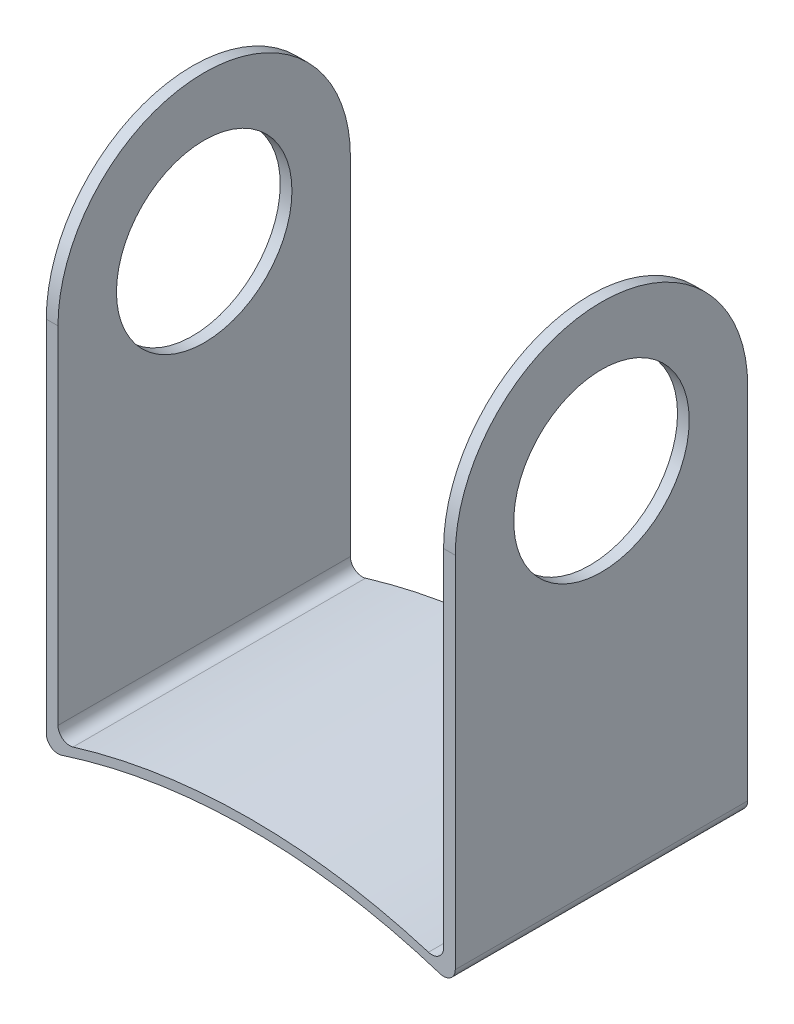
ISO-10303-21;
HEADER;
FILE_DESCRIPTION(('STEP AP214'),'2;1');
FILE_NAME('part.step','',(''),(''),'','','');
FILE_SCHEMA(('AUTOMOTIVE_DESIGN { 1 0 10303 214 1 1 1 1 }'));
ENDSEC;
DATA;
#1=APPLICATION_CONTEXT('core data for automotive mechanical design processes');
#2=APPLICATION_PROTOCOL_DEFINITION('international standard','automotive_design',2000,#1);
#3=PRODUCT_CONTEXT('',#1,'mechanical');
#4=PRODUCT('Part','Part','',(#3));
#5=PRODUCT_RELATED_PRODUCT_CATEGORY('part','',(#4));
#6=PRODUCT_DEFINITION_FORMATION('','',#4);
#7=PRODUCT_DEFINITION_CONTEXT('part definition',#1,'design');
#8=PRODUCT_DEFINITION('design','',#6,#7);
#9=PRODUCT_DEFINITION_SHAPE('','',#8);
#10=(LENGTH_UNIT() NAMED_UNIT(*) SI_UNIT(.MILLI.,.METRE.));
#11=(NAMED_UNIT(*) PLANE_ANGLE_UNIT() SI_UNIT($,.RADIAN.));
#12=(NAMED_UNIT(*) SI_UNIT($,.STERADIAN.) SOLID_ANGLE_UNIT());
#13=UNCERTAINTY_MEASURE_WITH_UNIT(LENGTH_MEASURE(1.E-05),#10,'distance_accuracy_value','');
#14=(GEOMETRIC_REPRESENTATION_CONTEXT(3) GLOBAL_UNCERTAINTY_ASSIGNED_CONTEXT((#13)) GLOBAL_UNIT_ASSIGNED_CONTEXT((#10,
#11,#12)) REPRESENTATION_CONTEXT('',''));
#15=CARTESIAN_POINT('',(0.,0.,0.));
#16=DIRECTION('',(0.,0.,1.));
#17=DIRECTION('',(1.,0.,0.));
#18=AXIS2_PLACEMENT_3D('',#15,#16,#17);
#19=CARTESIAN_POINT('',(-5.69097850008883,5.57643641199945,25.));
#20=DIRECTION('',(-1.,0.,0.));
#21=DIRECTION('',(0.,0.,1.));
#22=AXIS2_PLACEMENT_3D('',#19,#20,#21);
#23=PLANE('',#22);
#24=CARTESIAN_POINT('',(-5.69097850008883,36.5190090835511,12.5));
#25=DIRECTION('',(-1.,0.,0.));
#26=DIRECTION('',(0.,0.,1.));
#27=AXIS2_PLACEMENT_3D('',#24,#25,#26);
#28=CIRCLE('',#27,7.5);
#29=CARTESIAN_POINT('',(-5.69097850008883,36.5190090835511,20.));
#30=VERTEX_POINT('',#29);
#31=EDGE_CURVE('E148',#30,#30,#28,.T.);
#32=ORIENTED_EDGE('',*,*,#31,.T.);
#33=EDGE_LOOP('',(#32));
#34=FACE_BOUND('',#33,.T.);
#35=DIRECTION('',(0.,1.,0.));
#36=VECTOR('',#35,1.);
#37=CARTESIAN_POINT('',(-5.69097850008883,5.57643641199945,0.));
#38=LINE('',#37,#36);
#39=CARTESIAN_POINT('',(-5.69097850008883,6.9446235449061,0.));
#40=VERTEX_POINT('',#39);
#41=CARTESIAN_POINT('',(-5.69097850008883,36.5190090835511,0.));
#42=VERTEX_POINT('',#41);
#43=EDGE_CURVE('E138',#40,#42,#38,.T.);
#44=ORIENTED_EDGE('',*,*,#43,.T.);
#45=CARTESIAN_POINT('',(-5.69097850008883,36.5190090835511,12.5));
#46=DIRECTION('',(-1.,0.,0.));
#47=DIRECTION('',(0.,0.,1.));
#48=AXIS2_PLACEMENT_3D('',#45,#46,#47);
#49=CIRCLE('',#48,12.5);
#50=CARTESIAN_POINT('',(-5.69097850008883,36.5190090835511,25.));
#51=VERTEX_POINT('',#50);
#52=EDGE_CURVE('E130',#42,#51,#49,.F.);
#53=ORIENTED_EDGE('',*,*,#52,.T.);
#54=DIRECTION('',(0.,1.,0.));
#55=VECTOR('',#54,1.);
#56=CARTESIAN_POINT('',(-5.69097850008883,5.57643641199945,25.));
#57=LINE('',#56,#55);
#58=CARTESIAN_POINT('',(-5.69097850008883,6.9446235449061,25.));
#59=VERTEX_POINT('',#58);
#60=EDGE_CURVE('E164',#59,#51,#57,.T.);
#61=ORIENTED_EDGE('',*,*,#60,.F.);
#62=DIRECTION('',(0.,0.,-1.));
#63=VECTOR('',#62,1.);
#64=CARTESIAN_POINT('',(-5.69097850008883,6.9446235449061,25.));
#65=LINE('',#64,#63);
#66=EDGE_CURVE('E137',#59,#40,#65,.T.);
#67=ORIENTED_EDGE('',*,*,#66,.T.);
#68=EDGE_LOOP('',(#44,#53,#61,#67));
#69=FACE_BOUND('',#68,.T.);
#70=ADVANCED_FACE('F34',(#34,#69),#23,.F.);
#71=CARTESIAN_POINT('',(-6.69097850008883,50.,25.));
#72=DIRECTION('',(1.,0.,0.));
#73=DIRECTION('',(0.,1.,0.));
#74=AXIS2_PLACEMENT_3D('',#71,#72,#73);
#75=PLANE('',#74);
#76=CARTESIAN_POINT('',(-6.69097850008883,36.5190090835511,12.5));
#77=DIRECTION('',(1.,0.,0.));
#78=DIRECTION('',(0.,0.,-1.));
#79=AXIS2_PLACEMENT_3D('',#76,#77,#78);
#80=CIRCLE('',#79,7.5);
#81=CARTESIAN_POINT('',(-6.69097850008883,36.5190090835511,5.));
#82=VERTEX_POINT('',#81);
#83=EDGE_CURVE('E333',#82,#82,#80,.T.);
#84=ORIENTED_EDGE('',*,*,#83,.T.);
#85=EDGE_LOOP('',(#84));
#86=FACE_BOUND('',#85,.T.);
#87=DIRECTION('',(0.,-1.,0.));
#88=VECTOR('',#87,1.);
#89=CARTESIAN_POINT('',(-6.69097850008883,50.,25.));
#90=LINE('',#89,#88);
#91=CARTESIAN_POINT('',(-6.69097850008883,36.5190090835511,25.));
#92=VERTEX_POINT('',#91);
#93=CARTESIAN_POINT('',(-6.69097850008882,5.83988384729005,25.));
#94=VERTEX_POINT('',#93);
#95=EDGE_CURVE('E153',#92,#94,#90,.T.);
#96=ORIENTED_EDGE('',*,*,#95,.F.);
#97=CARTESIAN_POINT('',(-6.69097850008883,36.5190090835511,12.5));
#98=DIRECTION('',(-1.,0.,0.));
#99=DIRECTION('',(0.,0.,1.));
#100=AXIS2_PLACEMENT_3D('',#97,#98,#99);
#101=CIRCLE('',#100,12.5);
#102=CARTESIAN_POINT('',(-6.69097850008883,36.5190090835511,0.));
#103=VERTEX_POINT('',#102);
#104=EDGE_CURVE('E68',#92,#103,#101,.T.);
#105=ORIENTED_EDGE('',*,*,#104,.T.);
#106=DIRECTION('',(0.,-1.,0.));
#107=VECTOR('',#106,1.);
#108=CARTESIAN_POINT('',(-6.69097850008883,50.,0.));
#109=LINE('',#108,#107);
#110=CARTESIAN_POINT('',(-6.69097850008882,5.83988384729005,0.));
#111=VERTEX_POINT('',#110);
#112=EDGE_CURVE('E145',#103,#111,#109,.T.);
#113=ORIENTED_EDGE('',*,*,#112,.T.);
#114=DIRECTION('',(0.,0.,-1.));
#115=VECTOR('',#114,1.);
#116=CARTESIAN_POINT('',(-6.69097850008882,5.83988384729005,25.));
#117=LINE('',#116,#115);
#118=EDGE_CURVE('E155',#111,#94,#117,.F.);
#119=ORIENTED_EDGE('',*,*,#118,.T.);
#120=EDGE_LOOP('',(#96,#105,#113,#119));
#121=FACE_BOUND('',#120,.T.);
#122=ADVANCED_FACE('F259',(#86,#121),#75,.F.);
#123=CARTESIAN_POINT('',(10.7900631667596,-43.9030586080439,25.));
#124=DIRECTION('',(0.,0.,-1.));
#125=DIRECTION('',(-1.,0.,0.));
#126=AXIS2_PLACEMENT_3D('',#123,#124,#125);
#127=PLANE('',#126);
#128=DIRECTION('',(0.,1.,0.));
#129=VECTOR('',#128,1.);
#130=CARTESIAN_POINT('',(28.2711048336079,4.4444790096918,25.));
#131=LINE('',#130,#129);
#132=CARTESIAN_POINT('',(28.2711048336079,5.83988384729005,25.));
#133=VERTEX_POINT('',#132);
#134=CARTESIAN_POINT('',(28.2711048336079,36.5190090835511,25.));
#135=VERTEX_POINT('',#134);
#136=EDGE_CURVE('E158',#133,#135,#131,.T.);
#137=ORIENTED_EDGE('',*,*,#136,.T.);
#138=DIRECTION('',(1.,0.,0.));
#139=VECTOR('',#138,1.);
#140=CARTESIAN_POINT('',(-6.69097850008883,36.5190090835511,25.));
#141=LINE('',#140,#139);
#142=CARTESIAN_POINT('',(27.2711048336079,36.5190090835511,25.));
#143=VERTEX_POINT('',#142);
#144=EDGE_CURVE('E44',#143,#135,#141,.T.);
#145=ORIENTED_EDGE('',*,*,#144,.F.);
#146=DIRECTION('',(0.,1.,0.));
#147=VECTOR('',#146,1.);
#148=CARTESIAN_POINT('',(27.2711048336079,5.57643641199945,25.));
#149=LINE('',#148,#147);
#150=CARTESIAN_POINT('',(27.2711048336079,6.94462354490609,25.));
#151=VERTEX_POINT('',#150);
#152=EDGE_CURVE('E183',#151,#143,#149,.T.);
#153=ORIENTED_EDGE('',*,*,#152,.F.);
#154=CARTESIAN_POINT('',(26.2711048336079,6.94462354490609,25.));
#155=DIRECTION('',(0.,0.,-1.));
#156=DIRECTION('',(-1.,0.,0.));
#157=AXIS2_PLACEMENT_3D('',#154,#155,#156);
#158=CIRCLE('',#157,1.);
#159=CARTESIAN_POINT('',(25.979845757531,5.98797933173027,25.));
#160=VERTEX_POINT('',#159);
#161=EDGE_CURVE('E169',#151,#160,#158,.T.);
#162=ORIENTED_EDGE('',*,*,#161,.T.);
#163=CARTESIAN_POINT('',(10.7900631667596,-43.9030586080439,25.));
#164=DIRECTION('',(0.,0.,-1.));
#165=DIRECTION('',(-1.,0.,0.));
#166=AXIS2_PLACEMENT_3D('',#163,#164,#165);
#167=CIRCLE('',#166,52.1521347776185);
#168=CARTESIAN_POINT('',(-4.39971942401185,5.98797933173028,25.));
#169=VERTEX_POINT('',#168);
#170=EDGE_CURVE('E189',#169,#160,#167,.T.);
#171=ORIENTED_EDGE('',*,*,#170,.F.);
#172=CARTESIAN_POINT('',(-4.69097850008883,6.9446235449061,25.));
#173=DIRECTION('',(0.,0.,-1.));
#174=DIRECTION('',(-1.,0.,0.));
#175=AXIS2_PLACEMENT_3D('',#172,#173,#174);
#176=CIRCLE('',#175,1.);
#177=EDGE_CURVE('E165',#169,#59,#176,.T.);
#178=ORIENTED_EDGE('',*,*,#177,.T.);
#179=ORIENTED_EDGE('',*,*,#60,.T.);
#180=EDGE_CURVE('E132',#92,#51,#141,.T.);
#181=ORIENTED_EDGE('',*,*,#180,.F.);
#182=ORIENTED_EDGE('',*,*,#95,.T.);
#183=CARTESIAN_POINT('',(-5.69097850008883,5.83988384729005,25.));
#184=DIRECTION('',(0.,0.,-1.));
#185=DIRECTION('',(-1.,0.,0.));
#186=AXIS2_PLACEMENT_3D('',#183,#184,#185);
#187=CIRCLE('',#186,1.);
#188=CARTESIAN_POINT('',(-5.38206898915233,4.88879241422329,25.));
#189=VERTEX_POINT('',#188);
#190=EDGE_CURVE('E168',#94,#189,#187,.F.);
#191=ORIENTED_EDGE('',*,*,#190,.T.);
#192=CARTESIAN_POINT('',(10.7900631667596,-44.9030586080439,25.));
#193=DIRECTION('',(0.,0.,-1.));
#194=DIRECTION('',(-1.,0.,0.));
#195=AXIS2_PLACEMENT_3D('',#192,#193,#194);
#196=CIRCLE('',#195,52.3523283788977);
#197=CARTESIAN_POINT('',(26.9621953226714,4.88879241422329,25.));
#198=VERTEX_POINT('',#197);
#199=EDGE_CURVE('E196',#189,#198,#196,.T.);
#200=ORIENTED_EDGE('',*,*,#199,.T.);
#201=CARTESIAN_POINT('',(27.2711048336079,5.83988384729005,25.));
#202=DIRECTION('',(0.,0.,-1.));
#203=DIRECTION('',(-1.,0.,0.));
#204=AXIS2_PLACEMENT_3D('',#201,#202,#203);
#205=CIRCLE('',#204,1.);
#206=EDGE_CURVE('E197',#198,#133,#205,.F.);
#207=ORIENTED_EDGE('',*,*,#206,.T.);
#208=EDGE_LOOP('',(#137,#145,#153,#162,#171,#178,#179,#181,#182,#191,#200,#207));
#209=FACE_BOUND('',#208,.T.);
#210=ADVANCED_FACE('F36',(#209),#127,.F.);
#211=CARTESIAN_POINT('',(10.7900631667596,-43.9030586080439,0.));
#212=DIRECTION('',(0.,0.,-1.));
#213=DIRECTION('',(-1.,0.,0.));
#214=AXIS2_PLACEMENT_3D('',#211,#212,#213);
#215=PLANE('',#214);
#216=DIRECTION('',(1.,0.,0.));
#217=VECTOR('',#216,1.);
#218=CARTESIAN_POINT('',(-6.69097850008883,36.5190090835511,0.));
#219=LINE('',#218,#217);
#220=CARTESIAN_POINT('',(27.2711048336079,36.5190090835511,0.));
#221=VERTEX_POINT('',#220);
#222=CARTESIAN_POINT('',(28.2711048336079,36.5190090835512,0.));
#223=VERTEX_POINT('',#222);
#224=EDGE_CURVE('E52',#221,#223,#219,.T.);
#225=ORIENTED_EDGE('',*,*,#224,.T.);
#226=DIRECTION('',(0.,1.,0.));
#227=VECTOR('',#226,1.);
#228=CARTESIAN_POINT('',(28.2711048336079,4.4444790096918,0.));
#229=LINE('',#228,#227);
#230=CARTESIAN_POINT('',(28.2711048336079,5.83988384729005,0.));
#231=VERTEX_POINT('',#230);
#232=EDGE_CURVE('E194',#231,#223,#229,.T.);
#233=ORIENTED_EDGE('',*,*,#232,.F.);
#234=CARTESIAN_POINT('',(27.2711048336079,5.83988384729005,0.));
#235=DIRECTION('',(0.,0.,-1.));
#236=DIRECTION('',(-1.,0.,0.));
#237=AXIS2_PLACEMENT_3D('',#234,#235,#236);
#238=CIRCLE('',#237,1.);
#239=CARTESIAN_POINT('',(26.9621953226714,4.88879241422329,0.));
#240=VERTEX_POINT('',#239);
#241=EDGE_CURVE('E200',#231,#240,#238,.T.);
#242=ORIENTED_EDGE('',*,*,#241,.T.);
#243=CARTESIAN_POINT('',(10.7900631667596,-44.9030586080439,0.));
#244=DIRECTION('',(0.,0.,-1.));
#245=DIRECTION('',(-1.,0.,0.));
#246=AXIS2_PLACEMENT_3D('',#243,#244,#245);
#247=CIRCLE('',#246,52.3523283788977);
#248=CARTESIAN_POINT('',(-5.38206898915233,4.88879241422329,0.));
#249=VERTEX_POINT('',#248);
#250=EDGE_CURVE('E204',#249,#240,#247,.T.);
#251=ORIENTED_EDGE('',*,*,#250,.F.);
#252=CARTESIAN_POINT('',(-5.69097850008883,5.83988384729005,0.));
#253=DIRECTION('',(0.,0.,-1.));
#254=DIRECTION('',(-1.,0.,0.));
#255=AXIS2_PLACEMENT_3D('',#252,#253,#254);
#256=CIRCLE('',#255,1.);
#257=EDGE_CURVE('E146',#249,#111,#256,.T.);
#258=ORIENTED_EDGE('',*,*,#257,.T.);
#259=ORIENTED_EDGE('',*,*,#112,.F.);
#260=EDGE_CURVE('E74',#103,#42,#219,.T.);
#261=ORIENTED_EDGE('',*,*,#260,.T.);
#262=ORIENTED_EDGE('',*,*,#43,.F.);
#263=CARTESIAN_POINT('',(-4.69097850008883,6.9446235449061,0.));
#264=DIRECTION('',(0.,0.,-1.));
#265=DIRECTION('',(-1.,0.,0.));
#266=AXIS2_PLACEMENT_3D('',#263,#264,#265);
#267=CIRCLE('',#266,1.);
#268=CARTESIAN_POINT('',(-4.39971942401185,5.98797933173028,0.));
#269=VERTEX_POINT('',#268);
#270=EDGE_CURVE('E82',#40,#269,#267,.F.);
#271=ORIENTED_EDGE('',*,*,#270,.T.);
#272=CARTESIAN_POINT('',(10.7900631667596,-43.9030586080439,0.));
#273=DIRECTION('',(0.,0.,-1.));
#274=DIRECTION('',(-1.,0.,0.));
#275=AXIS2_PLACEMENT_3D('',#272,#273,#274);
#276=CIRCLE('',#275,52.1521347776185);
#277=CARTESIAN_POINT('',(25.979845757531,5.98797933173027,0.));
#278=VERTEX_POINT('',#277);
#279=EDGE_CURVE('E176',#269,#278,#276,.T.);
#280=ORIENTED_EDGE('',*,*,#279,.T.);
#281=CARTESIAN_POINT('',(26.2711048336079,6.94462354490609,0.));
#282=DIRECTION('',(0.,0.,-1.));
#283=DIRECTION('',(-1.,0.,0.));
#284=AXIS2_PLACEMENT_3D('',#281,#282,#283);
#285=CIRCLE('',#284,1.);
#286=CARTESIAN_POINT('',(27.2711048336079,6.94462354490609,0.));
#287=VERTEX_POINT('',#286);
#288=EDGE_CURVE('E178',#278,#287,#285,.F.);
#289=ORIENTED_EDGE('',*,*,#288,.T.);
#290=DIRECTION('',(0.,1.,0.));
#291=VECTOR('',#290,1.);
#292=CARTESIAN_POINT('',(27.2711048336079,5.57643641199945,0.));
#293=LINE('',#292,#291);
#294=EDGE_CURVE('E179',#287,#221,#293,.T.);
#295=ORIENTED_EDGE('',*,*,#294,.T.);
#296=EDGE_LOOP('',(#225,#233,#242,#251,#258,#259,#261,#262,#271,#280,#289,#295));
#297=FACE_BOUND('',#296,.T.);
#298=ADVANCED_FACE('F143',(#297),#215,.T.);
#299=CARTESIAN_POINT('',(10.7900631667596,-43.9030586080439,25.));
#300=DIRECTION('',(0.,0.,-1.));
#301=DIRECTION('',(-1.,0.,0.));
#302=AXIS2_PLACEMENT_3D('',#299,#300,#301);
#303=CYLINDRICAL_SURFACE('',#302,52.1521347776185);
#304=ORIENTED_EDGE('',*,*,#170,.T.);
#305=DIRECTION('',(0.,0.,-1.));
#306=VECTOR('',#305,1.);
#307=CARTESIAN_POINT('',(25.979845757531,5.98797933173028,25.));
#308=LINE('',#307,#306);
#309=EDGE_CURVE('E185',#160,#278,#308,.T.);
#310=ORIENTED_EDGE('',*,*,#309,.T.);
#311=ORIENTED_EDGE('',*,*,#279,.F.);
#312=DIRECTION('',(0.,0.,-1.));
#313=VECTOR('',#312,1.);
#314=CARTESIAN_POINT('',(-4.39971942401185,5.98797933173028,25.));
#315=LINE('',#314,#313);
#316=EDGE_CURVE('E188',#269,#169,#315,.F.);
#317=ORIENTED_EDGE('',*,*,#316,.T.);
#318=EDGE_LOOP('',(#304,#310,#311,#317));
#319=FACE_BOUND('',#318,.T.);
#320=ADVANCED_FACE('F246',(#319),#303,.T.);
#321=CARTESIAN_POINT('',(10.7900631667596,-44.9030586080439,25.));
#322=DIRECTION('',(0.,0.,-1.));
#323=DIRECTION('',(-1.,0.,0.));
#324=AXIS2_PLACEMENT_3D('',#321,#322,#323);
#325=CYLINDRICAL_SURFACE('',#324,52.3523283788977);
#326=ORIENTED_EDGE('',*,*,#199,.F.);
#327=DIRECTION('',(0.,0.,-1.));
#328=VECTOR('',#327,1.);
#329=CARTESIAN_POINT('',(-5.38206898915233,4.88879241422329,25.));
#330=LINE('',#329,#328);
#331=EDGE_CURVE('E191',#189,#249,#330,.T.);
#332=ORIENTED_EDGE('',*,*,#331,.T.);
#333=ORIENTED_EDGE('',*,*,#250,.T.);
#334=DIRECTION('',(0.,0.,-1.));
#335=VECTOR('',#334,1.);
#336=CARTESIAN_POINT('',(26.9621953226714,4.88879241422329,25.));
#337=LINE('',#336,#335);
#338=EDGE_CURVE('E205',#240,#198,#337,.F.);
#339=ORIENTED_EDGE('',*,*,#338,.T.);
#340=EDGE_LOOP('',(#326,#332,#333,#339));
#341=FACE_BOUND('',#340,.T.);
#342=ADVANCED_FACE('F272',(#341),#325,.F.);
#343=CARTESIAN_POINT('',(28.2711048336079,4.4444790096918,25.));
#344=DIRECTION('',(-1.,0.,0.));
#345=DIRECTION('',(0.,0.,1.));
#346=AXIS2_PLACEMENT_3D('',#343,#344,#345);
#347=PLANE('',#346);
#348=CARTESIAN_POINT('',(28.2711048336079,36.5190090835511,12.5));
#349=DIRECTION('',(1.,0.,0.));
#350=DIRECTION('',(0.,0.,-1.));
#351=AXIS2_PLACEMENT_3D('',#348,#349,#350);
#352=CIRCLE('',#351,7.5);
#353=CARTESIAN_POINT('',(28.2711048336079,36.5190090835511,5.));
#354=VERTEX_POINT('',#353);
#355=EDGE_CURVE('E335',#354,#354,#352,.T.);
#356=ORIENTED_EDGE('',*,*,#355,.F.);
#357=EDGE_LOOP('',(#356));
#358=FACE_BOUND('',#357,.T.);
#359=ORIENTED_EDGE('',*,*,#232,.T.);
#360=CARTESIAN_POINT('',(28.2711048336079,36.5190090835511,12.5));
#361=DIRECTION('',(-1.,0.,0.));
#362=DIRECTION('',(0.,0.,1.));
#363=AXIS2_PLACEMENT_3D('',#360,#361,#362);
#364=CIRCLE('',#363,12.5);
#365=EDGE_CURVE('E11',#135,#223,#364,.T.);
#366=ORIENTED_EDGE('',*,*,#365,.F.);
#367=ORIENTED_EDGE('',*,*,#136,.F.);
#368=DIRECTION('',(0.,0.,-1.));
#369=VECTOR('',#368,1.);
#370=CARTESIAN_POINT('',(28.2711048336079,5.83988384729005,25.));
#371=LINE('',#370,#369);
#372=EDGE_CURVE('E184',#133,#231,#371,.T.);
#373=ORIENTED_EDGE('',*,*,#372,.T.);
#374=EDGE_LOOP('',(#359,#366,#367,#373));
#375=FACE_BOUND('',#374,.T.);
#376=ADVANCED_FACE('F228',(#358,#375),#347,.F.);
#377=CARTESIAN_POINT('',(27.2711048336079,5.57643641199945,25.));
#378=DIRECTION('',(-1.,0.,0.));
#379=DIRECTION('',(0.,0.,1.));
#380=AXIS2_PLACEMENT_3D('',#377,#378,#379);
#381=PLANE('',#380);
#382=CARTESIAN_POINT('',(27.2711048336079,36.5190090835511,12.5));
#383=DIRECTION('',(-1.,0.,0.));
#384=DIRECTION('',(0.,0.,1.));
#385=AXIS2_PLACEMENT_3D('',#382,#383,#384);
#386=CIRCLE('',#385,7.5);
#387=CARTESIAN_POINT('',(27.2711048336079,36.5190090835511,20.));
#388=VERTEX_POINT('',#387);
#389=EDGE_CURVE('E38',#388,#388,#386,.T.);
#390=ORIENTED_EDGE('',*,*,#389,.F.);
#391=EDGE_LOOP('',(#390));
#392=FACE_BOUND('',#391,.T.);
#393=CARTESIAN_POINT('',(27.2711048336079,36.5190090835511,12.5));
#394=DIRECTION('',(-1.,0.,0.));
#395=DIRECTION('',(0.,0.,1.));
#396=AXIS2_PLACEMENT_3D('',#393,#394,#395);
#397=CIRCLE('',#396,12.5);
#398=EDGE_CURVE('E127',#221,#143,#397,.F.);
#399=ORIENTED_EDGE('',*,*,#398,.F.);
#400=ORIENTED_EDGE('',*,*,#294,.F.);
#401=DIRECTION('',(0.,0.,1.));
#402=VECTOR('',#401,1.);
#403=CARTESIAN_POINT('',(27.2711048336079,6.94462354490609,25.));
#404=LINE('',#403,#402);
#405=EDGE_CURVE('E181',#287,#151,#404,.T.);
#406=ORIENTED_EDGE('',*,*,#405,.T.);
#407=ORIENTED_EDGE('',*,*,#152,.T.);
#408=EDGE_LOOP('',(#399,#400,#406,#407));
#409=FACE_BOUND('',#408,.T.);
#410=ADVANCED_FACE('F240',(#392,#409),#381,.T.);
#411=CARTESIAN_POINT('',(-5.69097850008883,5.83988384729005,25.));
#412=DIRECTION('',(0.,0.,-1.));
#413=DIRECTION('',(-1.,0.,0.));
#414=AXIS2_PLACEMENT_3D('',#411,#412,#413);
#415=CYLINDRICAL_SURFACE('',#414,1.);
#416=ORIENTED_EDGE('',*,*,#190,.F.);
#417=ORIENTED_EDGE('',*,*,#118,.F.);
#418=ORIENTED_EDGE('',*,*,#257,.F.);
#419=ORIENTED_EDGE('',*,*,#331,.F.);
#420=EDGE_LOOP('',(#416,#417,#418,#419));
#421=FACE_BOUND('',#420,.T.);
#422=ADVANCED_FACE('F303',(#421),#415,.T.);
#423=CARTESIAN_POINT('',(27.2711048336079,5.83988384729005,25.));
#424=DIRECTION('',(0.,0.,-1.));
#425=DIRECTION('',(-1.,0.,0.));
#426=AXIS2_PLACEMENT_3D('',#423,#424,#425);
#427=CYLINDRICAL_SURFACE('',#426,1.);
#428=ORIENTED_EDGE('',*,*,#206,.F.);
#429=ORIENTED_EDGE('',*,*,#338,.F.);
#430=ORIENTED_EDGE('',*,*,#241,.F.);
#431=ORIENTED_EDGE('',*,*,#372,.F.);
#432=EDGE_LOOP('',(#428,#429,#430,#431));
#433=FACE_BOUND('',#432,.T.);
#434=ADVANCED_FACE('F235',(#433),#427,.T.);
#435=CARTESIAN_POINT('',(26.2711048336079,6.94462354490609,25.));
#436=DIRECTION('',(0.,0.,-1.));
#437=DIRECTION('',(-1.,0.,0.));
#438=AXIS2_PLACEMENT_3D('',#435,#436,#437);
#439=CYLINDRICAL_SURFACE('',#438,1.);
#440=ORIENTED_EDGE('',*,*,#161,.F.);
#441=ORIENTED_EDGE('',*,*,#405,.F.);
#442=ORIENTED_EDGE('',*,*,#288,.F.);
#443=ORIENTED_EDGE('',*,*,#309,.F.);
#444=EDGE_LOOP('',(#440,#441,#442,#443));
#445=FACE_BOUND('',#444,.T.);
#446=ADVANCED_FACE('F243',(#445),#439,.F.);
#447=CARTESIAN_POINT('',(-4.69097850008883,6.9446235449061,25.));
#448=DIRECTION('',(0.,0.,-1.));
#449=DIRECTION('',(-1.,0.,0.));
#450=AXIS2_PLACEMENT_3D('',#447,#448,#449);
#451=CYLINDRICAL_SURFACE('',#450,1.);
#452=ORIENTED_EDGE('',*,*,#177,.F.);
#453=ORIENTED_EDGE('',*,*,#316,.F.);
#454=ORIENTED_EDGE('',*,*,#270,.F.);
#455=ORIENTED_EDGE('',*,*,#66,.F.);
#456=EDGE_LOOP('',(#452,#453,#454,#455));
#457=FACE_BOUND('',#456,.T.);
#458=ADVANCED_FACE('F248',(#457),#451,.F.);
#459=CARTESIAN_POINT('',(-6.69097850008883,36.5190090835511,12.5));
#460=DIRECTION('',(1.,0.,0.));
#461=DIRECTION('',(0.,0.,-1.));
#462=AXIS2_PLACEMENT_3D('',#459,#460,#461);
#463=CYLINDRICAL_SURFACE('',#462,12.5);
#464=ORIENTED_EDGE('',*,*,#260,.F.);
#465=ORIENTED_EDGE('',*,*,#104,.F.);
#466=ORIENTED_EDGE('',*,*,#180,.T.);
#467=ORIENTED_EDGE('',*,*,#52,.F.);
#468=EDGE_LOOP('',(#464,#465,#466,#467));
#469=FACE_BOUND('',#468,.T.);
#470=ADVANCED_FACE('F131',(#469),#463,.T.);
#471=ORIENTED_EDGE('',*,*,#398,.T.);
#472=ORIENTED_EDGE('',*,*,#144,.T.);
#473=ORIENTED_EDGE('',*,*,#365,.T.);
#474=ORIENTED_EDGE('',*,*,#224,.F.);
#475=EDGE_LOOP('',(#471,#472,#473,#474));
#476=FACE_BOUND('',#475,.T.);
#477=ADVANCED_FACE('F224',(#476),#463,.T.);
#478=CARTESIAN_POINT('',(-6.69097850008883,36.5190090835511,12.5));
#479=DIRECTION('',(1.,0.,0.));
#480=DIRECTION('',(0.,0.,-1.));
#481=AXIS2_PLACEMENT_3D('',#478,#479,#480);
#482=CYLINDRICAL_SURFACE('',#481,7.5);
#483=ORIENTED_EDGE('',*,*,#389,.T.);
#484=EDGE_LOOP('',(#483));
#485=FACE_BOUND('',#484,.T.);
#486=ORIENTED_EDGE('',*,*,#355,.T.);
#487=EDGE_LOOP('',(#486));
#488=FACE_BOUND('',#487,.T.);
#489=ADVANCED_FACE('F311',(#485,#488),#482,.F.);
#490=ORIENTED_EDGE('',*,*,#83,.F.);
#491=EDGE_LOOP('',(#490));
#492=FACE_BOUND('',#491,.T.);
#493=ORIENTED_EDGE('',*,*,#31,.F.);
#494=EDGE_LOOP('',(#493));
#495=FACE_BOUND('',#494,.T.);
#496=ADVANCED_FACE('F316',(#492,#495),#482,.F.);
#497=CLOSED_SHELL('',(#70,#122,#210,#298,#320,#342,#376,#410,#422,#434,#446,#458,#470,#477,#489,#496));
#498=MANIFOLD_SOLID_BREP('B2',#497);
#499=ADVANCED_BREP_SHAPE_REPRESENTATION('',(#18,#498),#14);
#500=SHAPE_DEFINITION_REPRESENTATION(#9,#499);
ENDSEC;
END-ISO-10303-21;
